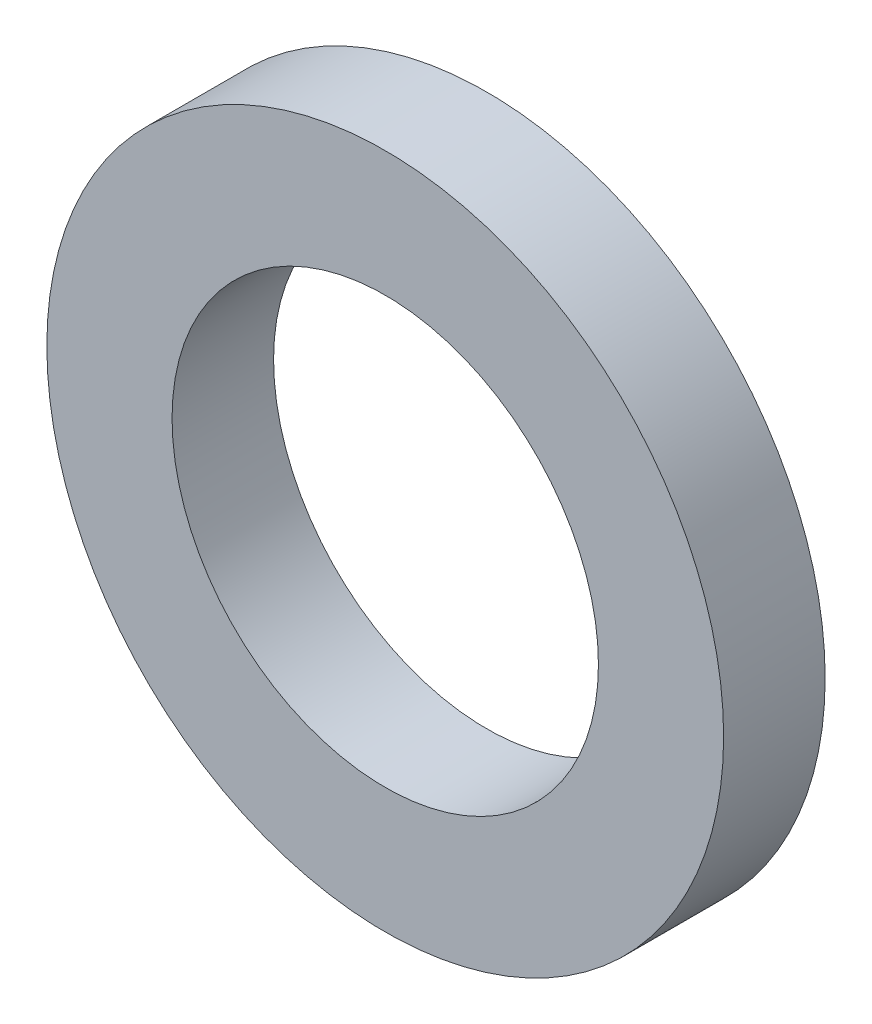
ISO-10303-21;
HEADER;
FILE_DESCRIPTION(('STEP AP214'),'2;1');
FILE_NAME('part.step','',(''),(''),'','','');
FILE_SCHEMA(('AUTOMOTIVE_DESIGN { 1 0 10303 214 1 1 1 1 }'));
ENDSEC;
DATA;
#1=APPLICATION_CONTEXT('core data for automotive mechanical design processes');
#2=APPLICATION_PROTOCOL_DEFINITION('international standard','automotive_design',2000,#1);
#3=PRODUCT_CONTEXT('',#1,'mechanical');
#4=PRODUCT('Part','Part','',(#3));
#5=PRODUCT_RELATED_PRODUCT_CATEGORY('part','',(#4));
#6=PRODUCT_DEFINITION_FORMATION('','',#4);
#7=PRODUCT_DEFINITION_CONTEXT('part definition',#1,'design');
#8=PRODUCT_DEFINITION('design','',#6,#7);
#9=PRODUCT_DEFINITION_SHAPE('','',#8);
#10=(LENGTH_UNIT() NAMED_UNIT(*) SI_UNIT(.MILLI.,.METRE.));
#11=(NAMED_UNIT(*) PLANE_ANGLE_UNIT() SI_UNIT($,.RADIAN.));
#12=(NAMED_UNIT(*) SI_UNIT($,.STERADIAN.) SOLID_ANGLE_UNIT());
#13=UNCERTAINTY_MEASURE_WITH_UNIT(LENGTH_MEASURE(1.E-05),#10,'distance_accuracy_value','');
#14=(GEOMETRIC_REPRESENTATION_CONTEXT(3) GLOBAL_UNCERTAINTY_ASSIGNED_CONTEXT((#13)) GLOBAL_UNIT_ASSIGNED_CONTEXT((#10,
#11,#12)) REPRESENTATION_CONTEXT('',''));
#15=CARTESIAN_POINT('',(0.,0.,0.));
#16=DIRECTION('',(0.,0.,1.));
#17=DIRECTION('',(1.,0.,0.));
#18=AXIS2_PLACEMENT_3D('',#15,#16,#17);
#19=CARTESIAN_POINT('',(0.,0.,3.));
#20=DIRECTION('',(0.,0.,1.));
#21=DIRECTION('',(1.,0.,0.));
#22=AXIS2_PLACEMENT_3D('',#19,#20,#21);
#23=PLANE('',#22);
#24=CARTESIAN_POINT('',(0.,0.,3.));
#25=DIRECTION('',(0.,0.,1.));
#26=DIRECTION('',(1.,0.,0.));
#27=AXIS2_PLACEMENT_3D('',#24,#25,#26);
#28=CIRCLE('',#27,10.);
#29=CARTESIAN_POINT('',(10.,0.,3.));
#30=VERTEX_POINT('',#29);
#31=EDGE_CURVE('E10',#30,#30,#28,.T.);
#32=ORIENTED_EDGE('',*,*,#31,.T.);
#33=EDGE_LOOP('',(#32));
#34=FACE_BOUND('',#33,.T.);
#35=CARTESIAN_POINT('',(0.,0.,3.));
#36=DIRECTION('',(0.,0.,1.));
#37=DIRECTION('',(1.,0.,0.));
#38=AXIS2_PLACEMENT_3D('',#35,#36,#37);
#39=CIRCLE('',#38,6.3);
#40=CARTESIAN_POINT('',(6.3,0.,3.));
#41=VERTEX_POINT('',#40);
#42=EDGE_CURVE('E56',#41,#41,#39,.T.);
#43=ORIENTED_EDGE('',*,*,#42,.F.);
#44=EDGE_LOOP('',(#43));
#45=FACE_BOUND('',#44,.T.);
#46=ADVANCED_FACE('F43',(#34,#45),#23,.T.);
#47=CARTESIAN_POINT('',(0.,0.,0.));
#48=DIRECTION('',(0.,0.,1.));
#49=DIRECTION('',(1.,0.,0.));
#50=AXIS2_PLACEMENT_3D('',#47,#48,#49);
#51=PLANE('',#50);
#52=CARTESIAN_POINT('',(0.,0.,0.));
#53=DIRECTION('',(0.,0.,1.));
#54=DIRECTION('',(1.,0.,0.));
#55=AXIS2_PLACEMENT_3D('',#52,#53,#54);
#56=CIRCLE('',#55,10.);
#57=CARTESIAN_POINT('',(10.,0.,0.));
#58=VERTEX_POINT('',#57);
#59=EDGE_CURVE('E47',#58,#58,#56,.T.);
#60=ORIENTED_EDGE('',*,*,#59,.F.);
#61=EDGE_LOOP('',(#60));
#62=FACE_BOUND('',#61,.T.);
#63=CARTESIAN_POINT('',(0.,0.,0.));
#64=DIRECTION('',(0.,0.,1.));
#65=DIRECTION('',(1.,0.,0.));
#66=AXIS2_PLACEMENT_3D('',#63,#64,#65);
#67=CIRCLE('',#66,6.3);
#68=CARTESIAN_POINT('',(6.3,0.,0.));
#69=VERTEX_POINT('',#68);
#70=EDGE_CURVE('E58',#69,#69,#67,.T.);
#71=ORIENTED_EDGE('',*,*,#70,.T.);
#72=EDGE_LOOP('',(#71));
#73=FACE_BOUND('',#72,.T.);
#74=ADVANCED_FACE('F70',(#62,#73),#51,.F.);
#75=CARTESIAN_POINT('',(0.,0.,3.));
#76=DIRECTION('',(0.,0.,-1.));
#77=DIRECTION('',(-1.,0.,0.));
#78=AXIS2_PLACEMENT_3D('',#75,#76,#77);
#79=CYLINDRICAL_SURFACE('',#78,10.);
#80=ORIENTED_EDGE('',*,*,#31,.F.);
#81=EDGE_LOOP('',(#80));
#82=FACE_BOUND('',#81,.T.);
#83=ORIENTED_EDGE('',*,*,#59,.T.);
#84=EDGE_LOOP('',(#83));
#85=FACE_BOUND('',#84,.T.);
#86=ADVANCED_FACE('F45',(#82,#85),#79,.T.);
#87=CARTESIAN_POINT('',(0.,0.,3.));
#88=DIRECTION('',(0.,0.,-1.));
#89=DIRECTION('',(-1.,0.,0.));
#90=AXIS2_PLACEMENT_3D('',#87,#88,#89);
#91=CYLINDRICAL_SURFACE('',#90,6.3);
#92=ORIENTED_EDGE('',*,*,#42,.T.);
#93=EDGE_LOOP('',(#92));
#94=FACE_BOUND('',#93,.T.);
#95=ORIENTED_EDGE('',*,*,#70,.F.);
#96=EDGE_LOOP('',(#95));
#97=FACE_BOUND('',#96,.T.);
#98=ADVANCED_FACE('F66',(#94,#97),#91,.F.);
#99=CLOSED_SHELL('',(#46,#74,#86,#98));
#100=MANIFOLD_SOLID_BREP('B2',#99);
#101=ADVANCED_BREP_SHAPE_REPRESENTATION('',(#18,#100),#14);
#102=SHAPE_DEFINITION_REPRESENTATION(#9,#101);
ENDSEC;
END-ISO-10303-21;
